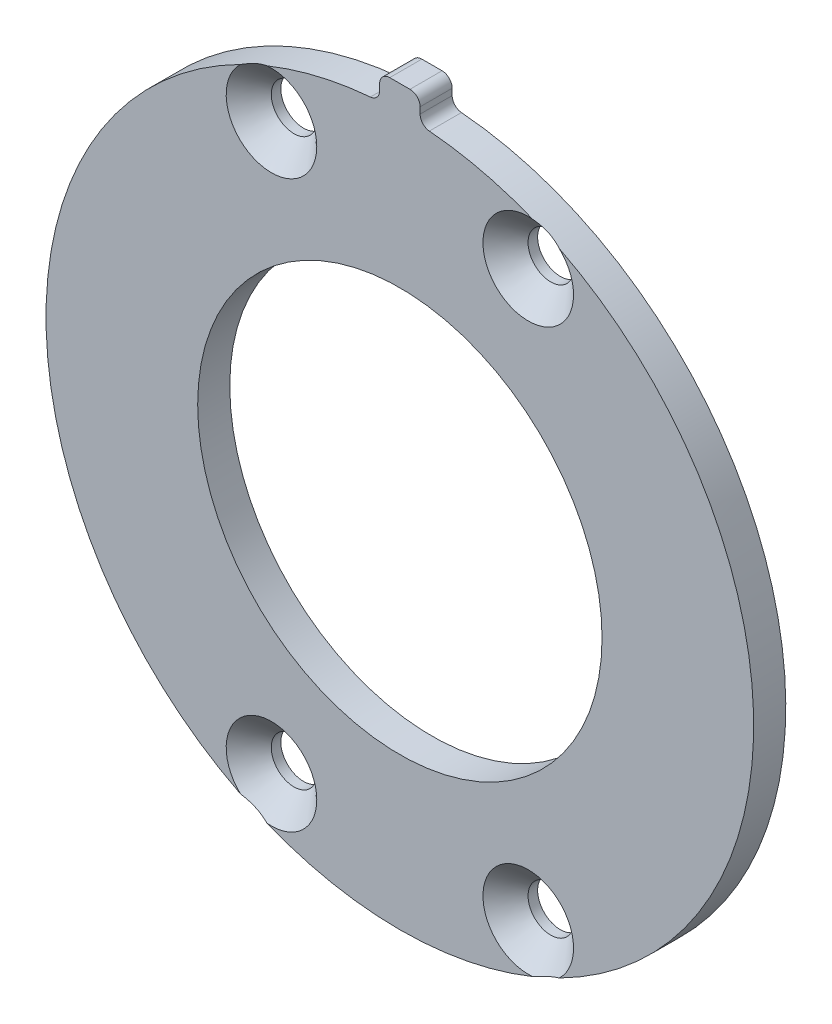
ISO-10303-21;
HEADER;
FILE_DESCRIPTION(('STEP AP214'),'2;1');
FILE_NAME('part.step','',(''),(''),'','','');
FILE_SCHEMA(('AUTOMOTIVE_DESIGN { 1 0 10303 214 1 1 1 1 }'));
ENDSEC;
DATA;
#1=APPLICATION_CONTEXT('core data for automotive mechanical design processes');
#2=APPLICATION_PROTOCOL_DEFINITION('international standard','automotive_design',2000,#1);
#3=PRODUCT_CONTEXT('',#1,'mechanical');
#4=PRODUCT('Part','Part','',(#3));
#5=PRODUCT_RELATED_PRODUCT_CATEGORY('part','',(#4));
#6=PRODUCT_DEFINITION_FORMATION('','',#4);
#7=PRODUCT_DEFINITION_CONTEXT('part definition',#1,'design');
#8=PRODUCT_DEFINITION('design','',#6,#7);
#9=PRODUCT_DEFINITION_SHAPE('','',#8);
#10=(LENGTH_UNIT() NAMED_UNIT(*) SI_UNIT(.MILLI.,.METRE.));
#11=(NAMED_UNIT(*) PLANE_ANGLE_UNIT() SI_UNIT($,.RADIAN.));
#12=(NAMED_UNIT(*) SI_UNIT($,.STERADIAN.) SOLID_ANGLE_UNIT());
#13=UNCERTAINTY_MEASURE_WITH_UNIT(LENGTH_MEASURE(1.E-05),#10,'distance_accuracy_value','');
#14=(GEOMETRIC_REPRESENTATION_CONTEXT(3) GLOBAL_UNCERTAINTY_ASSIGNED_CONTEXT((#13)) GLOBAL_UNIT_ASSIGNED_CONTEXT((#10,
#11,#12)) REPRESENTATION_CONTEXT('',''));
#15=CARTESIAN_POINT('',(0.,0.,0.));
#16=DIRECTION('',(0.,0.,1.));
#17=DIRECTION('',(1.,0.,0.));
#18=AXIS2_PLACEMENT_3D('',#15,#16,#17);
#19=CARTESIAN_POINT('',(0.,0.,3.175));
#20=DIRECTION('',(0.,0.,-1.));
#21=DIRECTION('',(-1.,0.,0.));
#22=AXIS2_PLACEMENT_3D('',#19,#20,#21);
#23=CYLINDRICAL_SURFACE('',#22,20.);
#24=CARTESIAN_POINT('',(0.,0.,3.175));
#25=DIRECTION('',(0.,0.,1.));
#26=DIRECTION('',(1.,0.,0.));
#27=AXIS2_PLACEMENT_3D('',#24,#25,#26);
#28=CIRCLE('',#27,20.);
#29=CARTESIAN_POINT('',(20.,0.,3.175));
#30=VERTEX_POINT('',#29);
#31=EDGE_CURVE('E163',#30,#30,#28,.T.);
#32=ORIENTED_EDGE('',*,*,#31,.T.);
#33=EDGE_LOOP('',(#32));
#34=FACE_BOUND('',#33,.T.);
#35=CARTESIAN_POINT('',(0.,0.,0.));
#36=DIRECTION('',(0.,0.,1.));
#37=DIRECTION('',(1.,0.,0.));
#38=AXIS2_PLACEMENT_3D('',#35,#36,#37);
#39=CIRCLE('',#38,20.);
#40=CARTESIAN_POINT('',(20.,0.,0.));
#41=VERTEX_POINT('',#40);
#42=EDGE_CURVE('E323',#41,#41,#39,.T.);
#43=ORIENTED_EDGE('',*,*,#42,.F.);
#44=EDGE_LOOP('',(#43));
#45=FACE_BOUND('',#44,.T.);
#46=ADVANCED_FACE('F47',(#34,#45),#23,.F.);
#47=CARTESIAN_POINT('',(0.,0.,3.175));
#48=DIRECTION('',(0.,0.,-1.));
#49=DIRECTION('',(-1.,0.,0.));
#50=AXIS2_PLACEMENT_3D('',#47,#48,#49);
#51=CYLINDRICAL_SURFACE('',#50,35.);
#52=CARTESIAN_POINT('',(0.,0.,3.175));
#53=DIRECTION('',(0.,0.,1.));
#54=DIRECTION('',(1.,0.,0.));
#55=AXIS2_PLACEMENT_3D('',#52,#53,#54);
#56=CIRCLE('',#55,35.);
#57=CARTESIAN_POINT('',(-2.91666666666667,34.8782605007124,3.175));
#58=VERTEX_POINT('',#57);
#59=CARTESIAN_POINT('',(-13.1457830587167,32.4374534723853,3.175));
#60=VERTEX_POINT('',#59);
#61=EDGE_CURVE('E151',#58,#60,#56,.T.);
#62=ORIENTED_EDGE('',*,*,#61,.F.);
#63=DIRECTION('',(0.,0.,-1.));
#64=VECTOR('',#63,1.);
#65=CARTESIAN_POINT('',(-2.91666666666667,34.8782605007124,3.175));
#66=LINE('',#65,#64);
#67=CARTESIAN_POINT('',(-2.91666666666667,34.8782605007124,0.));
#68=VERTEX_POINT('',#67);
#69=EDGE_CURVE('E263',#58,#68,#66,.T.);
#70=ORIENTED_EDGE('',*,*,#69,.T.);
#71=CARTESIAN_POINT('',(0.,0.,0.));
#72=DIRECTION('',(0.,0.,1.));
#73=DIRECTION('',(1.,0.,0.));
#74=AXIS2_PLACEMENT_3D('',#71,#72,#73);
#75=CIRCLE('',#74,35.);
#76=CARTESIAN_POINT('',(2.91666666666667,34.8782605007124,0.));
#77=VERTEX_POINT('',#76);
#78=EDGE_CURVE('E182',#68,#77,#75,.T.);
#79=ORIENTED_EDGE('',*,*,#78,.T.);
#80=DIRECTION('',(0.,0.,-1.));
#81=VECTOR('',#80,1.);
#82=CARTESIAN_POINT('',(2.91666666666667,34.8782605007124,3.175));
#83=LINE('',#82,#81);
#84=CARTESIAN_POINT('',(2.91666666666667,34.8782605007124,3.175));
#85=VERTEX_POINT('',#84);
#86=EDGE_CURVE('E142',#77,#85,#83,.F.);
#87=ORIENTED_EDGE('',*,*,#86,.T.);
#88=CARTESIAN_POINT('',(13.1457830587149,32.437453472386,3.175));
#89=VERTEX_POINT('',#88);
#90=EDGE_CURVE('E161',#89,#85,#56,.T.);
#91=ORIENTED_EDGE('',*,*,#90,.F.);
#92=CARTESIAN_POINT('',(12.7530802206111,32.5938482675283,3.30946606861702));
#93=CARTESIAN_POINT('',(12.8177837794812,32.5685314442767,3.28489627540469));
#94=CARTESIAN_POINT('',(12.8827550508194,32.5428878404432,3.26137405625743));
#95=CARTESIAN_POINT('',(13.0134395880967,32.4908503525877,3.21654519717089));
#96=CARTESIAN_POINT('',(13.0791546214918,32.4644542222017,3.19524632853202));
#97=CARTESIAN_POINT('',(13.2781189833976,32.383825201883,3.13478708581808));
#98=CARTESIAN_POINT('',(13.4121500121269,32.3285571051347,3.09946469331322));
#99=CARTESIAN_POINT('',(13.6817529834378,32.2153846746017,3.04062640104528));
#100=CARTESIAN_POINT('',(13.8173253376726,32.1574796235158,3.01711373492695));
#101=CARTESIAN_POINT('',(14.0889143117362,32.0394189677215,2.98323073950611));
#102=CARTESIAN_POINT('',(14.2249299172378,31.9792669904965,2.97284009602487));
#103=CARTESIAN_POINT('',(14.4964231231112,31.8571166752754,2.96576514402205));
#104=CARTESIAN_POINT('',(14.6319008832349,31.7951189406272,2.96907640436761));
#105=CARTESIAN_POINT('',(14.9363760066117,31.6534309110511,2.99185191526379));
#106=CARTESIAN_POINT('',(15.1049043286439,31.573341780462,3.01530217304525));
#107=CARTESIAN_POINT('',(15.3542480434255,31.4524345798508,3.06497517022203));
#108=CARTESIAN_POINT('',(15.4367935703604,31.4120003579427,3.08395097028311));
#109=CARTESIAN_POINT('',(15.6006504882809,31.3309439968307,3.12634316917397));
#110=CARTESIAN_POINT('',(15.681961821879,31.2903218490025,3.14975977381318));
#111=CARTESIAN_POINT('',(15.9923328443849,31.1337672639739,3.24766130036524));
#112=CARTESIAN_POINT('',(16.2166995684813,31.0174124418311,3.33653982026261));
#113=CARTESIAN_POINT('',(16.6545671327644,30.7845278694084,3.53794196056448));
#114=CARTESIAN_POINT('',(16.8680480770957,30.6679981732285,3.65050707495304));
#115=CARTESIAN_POINT('',(17.286784530432,30.4339446104218,3.89296996968937));
#116=CARTESIAN_POINT('',(17.4919688421297,30.3164196822448,4.02298796882929));
#117=CARTESIAN_POINT('',(17.8938949217776,30.0809365991982,4.29464457004465));
#118=CARTESIAN_POINT('',(18.0906420136845,29.9629787700724,4.43627567480205));
#119=CARTESIAN_POINT('',(18.3850618123991,29.7826047596978,4.65840910359178));
#120=CARTESIAN_POINT('',(18.4852580054248,29.7205143131009,4.73587028328792));
#121=CARTESIAN_POINT('',(18.6839134790919,29.596032207709,4.89275701113362));
#122=CARTESIAN_POINT('',(18.7823727517777,29.5336405475359,4.97218256827677));
#123=CARTESIAN_POINT('',(18.9765351645422,29.4092544850332,5.13174663382806));
#124=CARTESIAN_POINT('',(19.0722571528218,29.3472641723716,5.2118654543554));
#125=CARTESIAN_POINT('',(19.2622565441203,29.222907925896,5.37350896485753));
#126=CARTESIAN_POINT('',(19.3565339717829,29.1605419985151,5.45503363079859));
#127=CARTESIAN_POINT('',(19.450147410684,29.097968411947,5.53715187378861));
#128=B_SPLINE_CURVE_WITH_KNOTS('',3,(#92,#93,#94,#95,#96,#97,#98,#99,#100,#101,#102,#103,#104,
#105,#106,#107,#108,#109,#110,#111,#112,#113,#114,#115,#116,#117,#118,#119,#120,#121,#122,#123,
#124,#125,#126,#127),.UNSPECIFIED.,.F.,.F.,(4,2,2,2,2,2,2,2,2,2,2,2,2,2,2,2,2,4),(0.,
0.221073406332503,0.442895336225531,0.890082989672575,1.33739302180363,1.7840097218162,
2.23048199932607,2.79334869605478,3.07482209858569,3.35630854921195,4.15806534559636,
4.96123852307315,5.77025894227303,6.57876111640781,7.00188780428454,7.42501642973659,
7.84311692980672,8.26121028928092),.UNSPECIFIED.);
#129=CARTESIAN_POINT('',(15.7619791753685,31.2499601995786,3.175));
#130=VERTEX_POINT('',#129);
#131=EDGE_CURVE('E143',#89,#130,#128,.T.);
#132=ORIENTED_EDGE('',*,*,#131,.T.);
#133=CARTESIAN_POINT('',(15.7619791753684,-31.2499601995788,3.175));
#134=VERTEX_POINT('',#133);
#135=EDGE_CURVE('E162',#134,#130,#56,.T.);
#136=ORIENTED_EDGE('',*,*,#135,.F.);
#137=CARTESIAN_POINT('',(15.7626133632051,-31.2496403173238,3.17520000000069));
#138=CARTESIAN_POINT('',(15.6978293351409,-31.2823179975497,3.1547643543795));
#139=CARTESIAN_POINT('',(15.6326183930712,-31.3149581921728,3.1356341093607));
#140=CARTESIAN_POINT('',(15.5013664369167,-31.3801372189379,3.10018476086793));
#141=CARTESIAN_POINT('',(15.4353252172812,-31.4126760233879,3.08386636883429));
#142=CARTESIAN_POINT('',(15.2359306309192,-31.5101300498544,3.03941955783499));
#143=CARTESIAN_POINT('',(15.101414375926,-31.5748283404476,3.01583423012008));
#144=CARTESIAN_POINT('',(14.8335546609062,-31.7015309290892,2.98254478899766));
#145=CARTESIAN_POINT('',(14.7002650492463,-31.7635622272398,2.9725104636828));
#146=CARTESIAN_POINT('',(14.4327164177344,-31.8860205748792,2.96584883062085));
#147=CARTESIAN_POINT('',(14.2984582401738,-31.9464488444163,2.96921101398393));
#148=CARTESIAN_POINT('',(14.0793214053752,-32.0434292519206,2.98544321619201));
#149=CARTESIAN_POINT('',(13.994402167229,-32.0806054886866,2.99437135050943));
#150=CARTESIAN_POINT('',(13.8248352570549,-32.1540427093884,3.01727908424546));
#151=CARTESIAN_POINT('',(13.7401876140638,-32.1903035981336,3.03125920674409));
#152=CARTESIAN_POINT('',(13.5700567062427,-32.2623965570017,3.06423351412097));
#153=CARTESIAN_POINT('',(13.4845815973138,-32.2982126055764,3.08330399282949));
#154=CARTESIAN_POINT('',(13.3143052401821,-32.3687779249475,3.12596199737166));
#155=CARTESIAN_POINT('',(13.2295040733561,-32.4035270683258,3.14955006031386));
#156=CARTESIAN_POINT('',(13.1451247657722,-32.4377202480736,3.17520000000003));
#157=B_SPLINE_CURVE_WITH_KNOTS('',3,(#137,#138,#139,#140,#141,#142,#143,#144,#145,#146,#147,
#148,#149,#150,#151,#152,#153,#154,#155,#156),.UNSPECIFIED.,.F.,.F.,(4,2,2,2,2,2,2,2,2,4),(0.,
0.226122346154235,0.452301820861845,0.90503740633218,1.3465286323258,1.78767359878422,
2.06693089485356,2.34621711335468,2.62995037343929,2.91371738834988),.UNSPECIFIED.);
#158=CARTESIAN_POINT('',(13.1457830587147,-32.4374534723861,3.175));
#159=VERTEX_POINT('',#158);
#160=EDGE_CURVE('E169',#134,#159,#157,.T.);
#161=ORIENTED_EDGE('',*,*,#160,.T.);
#162=CARTESIAN_POINT('',(-13.1457830587147,-32.4374534723861,3.175));
#163=VERTEX_POINT('',#162);
#164=EDGE_CURVE('E159',#163,#159,#56,.T.);
#165=ORIENTED_EDGE('',*,*,#164,.F.);
#166=CARTESIAN_POINT('',(-12.7530802206111,-32.5938482675283,3.30946606861701));
#167=CARTESIAN_POINT('',(-12.8177837794809,-32.5685314442768,3.28489627540483));
#168=CARTESIAN_POINT('',(-12.8827550508187,-32.5428878404435,3.26137405625768));
#169=CARTESIAN_POINT('',(-13.0134395880952,-32.4908503525883,3.21654519717136));
#170=CARTESIAN_POINT('',(-13.0791546214901,-32.4644542222024,3.19524632853259));
#171=CARTESIAN_POINT('',(-13.2781189833955,-32.3838252018839,3.13478708581865));
#172=CARTESIAN_POINT('',(-13.4121500121249,-32.3285571051355,3.09946469331372));
#173=CARTESIAN_POINT('',(-13.6817529834358,-32.2153846746025,3.04062640104564));
#174=CARTESIAN_POINT('',(-13.8173253376707,-32.1574796235167,3.01711373492725));
#175=CARTESIAN_POINT('',(-14.0889143117344,-32.0394189677223,2.98323073950627));
#176=CARTESIAN_POINT('',(-14.2249299172361,-31.9792669904973,2.97284009602497));
#177=CARTESIAN_POINT('',(-14.4964231231096,-31.8571166752762,2.96576514402203));
#178=CARTESIAN_POINT('',(-14.6319008832334,-31.7951189406279,2.96907640436754));
#179=CARTESIAN_POINT('',(-14.9363760066105,-31.6534309110517,2.99185191526362));
#180=CARTESIAN_POINT('',(-15.1049043286429,-31.5733417804624,3.01530217304507));
#181=CARTESIAN_POINT('',(-15.3542480434249,-31.4524345798511,3.06497517022189));
#182=CARTESIAN_POINT('',(-15.4367935703599,-31.4120003579429,3.08395097028299));
#183=CARTESIAN_POINT('',(-15.6006504882807,-31.3309439968308,3.12634316917391));
#184=CARTESIAN_POINT('',(-15.6819618218789,-31.2903218490025,3.14975977381315));
#185=CARTESIAN_POINT('',(-15.9923328443849,-31.1337672639738,3.24766130036523));
#186=CARTESIAN_POINT('',(-16.2166995684813,-31.0174124418311,3.33653982026261));
#187=CARTESIAN_POINT('',(-16.6545671327644,-30.7845278694084,3.5379419605645));
#188=CARTESIAN_POINT('',(-16.8680480770958,-30.6679981732285,3.65050707495306));
#189=CARTESIAN_POINT('',(-17.2867845304321,-30.4339446104218,3.8929699696894));
#190=CARTESIAN_POINT('',(-17.4919688421298,-30.3164196822448,4.02298796882932));
#191=CARTESIAN_POINT('',(-17.8938949217777,-30.0809365991981,4.29464457004469));
#192=CARTESIAN_POINT('',(-18.0906420136846,-29.9629787700723,4.43627567480209));
#193=CARTESIAN_POINT('',(-18.3850618123992,-29.7826047596977,4.65840910359182));
#194=CARTESIAN_POINT('',(-18.4852580054248,-29.7205143131009,4.73587028328795));
#195=CARTESIAN_POINT('',(-18.683913479092,-29.596032207709,4.89275701113365));
#196=CARTESIAN_POINT('',(-18.7823727517777,-29.5336405475359,4.97218256827679));
#197=CARTESIAN_POINT('',(-18.9765351645422,-29.4092544850332,5.13174663382808));
#198=CARTESIAN_POINT('',(-19.0722571528218,-29.3472641723716,5.21186545435541));
#199=CARTESIAN_POINT('',(-19.2622565441204,-29.222907925896,5.37350896485754));
#200=CARTESIAN_POINT('',(-19.3565339717829,-29.1605419985151,5.45503363079859));
#201=CARTESIAN_POINT('',(-19.450147410684,-29.097968411947,5.53715187378861));
#202=B_SPLINE_CURVE_WITH_KNOTS('',3,(#166,#167,#168,#169,#170,#171,#172,#173,#174,#175,#176,
#177,#178,#179,#180,#181,#182,#183,#184,#185,#186,#187,#188,#189,#190,#191,#192,#193,#194,#195,
#196,#197,#198,#199,#200,#201),.UNSPECIFIED.,.F.,.F.,(4,2,2,2,2,2,2,2,2,2,2,2,2,2,2,2,2,4),(0.,
0.221073406331293,0.442895336223102,0.890082989670337,1.33739302180159,1.78400972181435,
2.23048199932441,2.79334869605397,3.0748220985853,3.35630854921198,4.1580653455964,
4.96123852307321,5.77025894227309,6.57876111640789,7.0018878042846,7.42501642973663,
7.84311692980674,8.26121028928092),.UNSPECIFIED.);
#203=CARTESIAN_POINT('',(-15.7619791753685,-31.2499601995786,3.175));
#204=VERTEX_POINT('',#203);
#205=EDGE_CURVE('E158',#163,#204,#202,.T.);
#206=ORIENTED_EDGE('',*,*,#205,.T.);
#207=CARTESIAN_POINT('',(-15.7619791753652,31.2499601995804,3.175));
#208=VERTEX_POINT('',#207);
#209=EDGE_CURVE('E149',#208,#204,#56,.T.);
#210=ORIENTED_EDGE('',*,*,#209,.F.);
#211=CARTESIAN_POINT('',(-15.7626133632018,31.2496403173255,3.17520000000069));
#212=CARTESIAN_POINT('',(-15.6978293351376,31.2823179975514,3.15476435437954));
#213=CARTESIAN_POINT('',(-15.6326183930679,31.3149581921744,3.13563410936079));
#214=CARTESIAN_POINT('',(-15.5013664369134,31.3801372189395,3.10018476086811));
#215=CARTESIAN_POINT('',(-15.4353252172779,31.4126760233895,3.08386636883453));
#216=CARTESIAN_POINT('',(-15.235930630916,31.5101300498559,3.03941955783537));
#217=CARTESIAN_POINT('',(-15.1014143759228,31.5748283404491,3.01583423012055));
#218=CARTESIAN_POINT('',(-14.8335546609031,31.7015309290906,2.9825447889983));
#219=CARTESIAN_POINT('',(-14.7002650492433,31.7635622272412,2.97251046368353));
#220=CARTESIAN_POINT('',(-14.4327164177314,31.8860205748806,2.96584883062173));
#221=CARTESIAN_POINT('',(-14.2984582401708,31.9464488444176,2.96921101398489));
#222=CARTESIAN_POINT('',(-14.0793214053725,32.0434292519218,2.98544321619306));
#223=CARTESIAN_POINT('',(-13.9944021672265,32.0806054886877,2.99437135051049));
#224=CARTESIAN_POINT('',(-13.8248352570529,32.1540427093893,3.01727908424652));
#225=CARTESIAN_POINT('',(-13.7401876140621,32.1903035981343,3.03125920674513));
#226=CARTESIAN_POINT('',(-13.5700567062414,32.2623965570022,3.06423351412195));
#227=CARTESIAN_POINT('',(-13.4845815973127,32.2982126055769,3.08330399283042));
#228=CARTESIAN_POINT('',(-13.3143052401815,32.3687779249477,3.12596199737247));
#229=CARTESIAN_POINT('',(-13.2295040733557,32.4035270683259,3.14955006031459));
#230=CARTESIAN_POINT('',(-13.145124765772,32.4377202480737,3.17520000000068));
#231=B_SPLINE_CURVE_WITH_KNOTS('',3,(#211,#212,#213,#214,#215,#216,#217,#218,#219,#220,#221,
#222,#223,#224,#225,#226,#227,#228,#229,#230),.UNSPECIFIED.,.F.,.F.,(4,2,2,2,2,2,2,2,2,4),(0.,
0.226122346154146,0.452301820861672,0.905037406331823,1.34652863232529,1.78767359878356,
2.06693089485215,2.34621711335253,2.62995037343637,2.9137173883462),.UNSPECIFIED.);
#232=EDGE_CURVE('E135',#208,#60,#231,.T.);
#233=ORIENTED_EDGE('',*,*,#232,.T.);
#234=EDGE_LOOP('',(#62,#70,#79,#87,#91,#132,#136,#161,#165,#206,#210,#233));
#235=FACE_BOUND('',#234,.T.);
#236=ADVANCED_FACE('F156',(#235),#51,.T.);
#237=CARTESIAN_POINT('',(0.,0.,3.175));
#238=DIRECTION('',(0.,0.,1.));
#239=DIRECTION('',(1.,0.,0.));
#240=AXIS2_PLACEMENT_3D('',#237,#238,#239);
#241=PLANE('',#240);
#242=DIRECTION('',(1.,0.,0.));
#243=VECTOR('',#242,1.);
#244=CARTESIAN_POINT('',(-2.,37.5,3.175));
#245=LINE('',#244,#243);
#246=CARTESIAN_POINT('',(-1.,37.5,3.175));
#247=VERTEX_POINT('',#246);
#248=CARTESIAN_POINT('',(0.999999999999998,37.5,3.175));
#249=VERTEX_POINT('',#248);
#250=EDGE_CURVE('E282',#247,#249,#245,.T.);
#251=ORIENTED_EDGE('',*,*,#250,.F.);
#252=CARTESIAN_POINT('',(-1.,36.5,3.175));
#253=DIRECTION('',(0.,0.,1.));
#254=DIRECTION('',(1.,0.,0.));
#255=AXIS2_PLACEMENT_3D('',#252,#253,#254);
#256=CIRCLE('',#255,1.);
#257=CARTESIAN_POINT('',(-2.,36.5,3.175));
#258=VERTEX_POINT('',#257);
#259=EDGE_CURVE('E242',#247,#258,#256,.T.);
#260=ORIENTED_EDGE('',*,*,#259,.T.);
#261=DIRECTION('',(0.,1.,0.));
#262=VECTOR('',#261,1.);
#263=CARTESIAN_POINT('',(-2.,32.5,3.175));
#264=LINE('',#263,#262);
#265=CARTESIAN_POINT('',(-2.,35.8747822293042,3.175));
#266=VERTEX_POINT('',#265);
#267=EDGE_CURVE('E258',#266,#258,#264,.T.);
#268=ORIENTED_EDGE('',*,*,#267,.F.);
#269=CARTESIAN_POINT('',(-3.,35.8747822293042,3.175));
#270=DIRECTION('',(0.,0.,1.));
#271=DIRECTION('',(1.,0.,0.));
#272=AXIS2_PLACEMENT_3D('',#269,#270,#271);
#273=CIRCLE('',#272,1.);
#274=EDGE_CURVE('E254',#266,#58,#273,.F.);
#275=ORIENTED_EDGE('',*,*,#274,.T.);
#276=ORIENTED_EDGE('',*,*,#61,.T.);
#277=CARTESIAN_POINT('',(-12.699999999999,27.9796874999995,3.175));
#278=DIRECTION('',(0.,0.,1.));
#279=DIRECTION('',(1.,0.,0.));
#280=AXIS2_PLACEMENT_3D('',#277,#278,#279);
#281=CIRCLE('',#280,4.48);
#282=EDGE_CURVE('E138',#208,#60,#281,.T.);
#283=ORIENTED_EDGE('',*,*,#282,.F.);
#284=ORIENTED_EDGE('',*,*,#209,.T.);
#285=CARTESIAN_POINT('',(-12.7,-27.9796875,3.175));
#286=DIRECTION('',(0.,0.,1.));
#287=DIRECTION('',(1.,0.,0.));
#288=AXIS2_PLACEMENT_3D('',#285,#286,#287);
#289=CIRCLE('',#288,4.48);
#290=EDGE_CURVE('E307',#163,#204,#289,.T.);
#291=ORIENTED_EDGE('',*,*,#290,.F.);
#292=ORIENTED_EDGE('',*,*,#164,.T.);
#293=CARTESIAN_POINT('',(12.7,-27.9796875,3.175));
#294=DIRECTION('',(0.,0.,1.));
#295=DIRECTION('',(1.,0.,0.));
#296=AXIS2_PLACEMENT_3D('',#293,#294,#295);
#297=CIRCLE('',#296,4.48);
#298=EDGE_CURVE('E315',#134,#159,#297,.T.);
#299=ORIENTED_EDGE('',*,*,#298,.F.);
#300=ORIENTED_EDGE('',*,*,#135,.T.);
#301=CARTESIAN_POINT('',(12.7,27.9796875,3.175));
#302=DIRECTION('',(0.,0.,1.));
#303=DIRECTION('',(1.,0.,0.));
#304=AXIS2_PLACEMENT_3D('',#301,#302,#303);
#305=CIRCLE('',#304,4.48);
#306=EDGE_CURVE('E299',#89,#130,#305,.T.);
#307=ORIENTED_EDGE('',*,*,#306,.F.);
#308=ORIENTED_EDGE('',*,*,#90,.T.);
#309=CARTESIAN_POINT('',(3.,35.8747822293042,3.175));
#310=DIRECTION('',(0.,0.,1.));
#311=DIRECTION('',(1.,0.,0.));
#312=AXIS2_PLACEMENT_3D('',#309,#310,#311);
#313=CIRCLE('',#312,1.);
#314=CARTESIAN_POINT('',(2.,35.8747822293042,3.175));
#315=VERTEX_POINT('',#314);
#316=EDGE_CURVE('E55',#85,#315,#313,.F.);
#317=ORIENTED_EDGE('',*,*,#316,.T.);
#318=DIRECTION('',(0.,-1.,0.));
#319=VECTOR('',#318,1.);
#320=CARTESIAN_POINT('',(2.,32.5,3.175));
#321=LINE('',#320,#319);
#322=CARTESIAN_POINT('',(2.,36.5,3.175));
#323=VERTEX_POINT('',#322);
#324=EDGE_CURVE('E153',#323,#315,#321,.T.);
#325=ORIENTED_EDGE('',*,*,#324,.F.);
#326=CARTESIAN_POINT('',(0.999999999999998,36.5,3.175));
#327=DIRECTION('',(0.,0.,1.));
#328=DIRECTION('',(1.,0.,0.));
#329=AXIS2_PLACEMENT_3D('',#326,#327,#328);
#330=CIRCLE('',#329,1.);
#331=EDGE_CURVE('E238',#323,#249,#330,.T.);
#332=ORIENTED_EDGE('',*,*,#331,.T.);
#333=EDGE_LOOP('',(#251,#260,#268,#275,#276,#283,#284,#291,#292,#299,#300,#307,#308,#317,#325,#332));
#334=FACE_BOUND('',#333,.T.);
#335=ORIENTED_EDGE('',*,*,#31,.F.);
#336=EDGE_LOOP('',(#335));
#337=FACE_BOUND('',#336,.T.);
#338=ADVANCED_FACE('F146',(#334,#337),#241,.T.);
#339=CARTESIAN_POINT('',(0.,0.,0.));
#340=DIRECTION('',(0.,0.,1.));
#341=DIRECTION('',(1.,0.,0.));
#342=AXIS2_PLACEMENT_3D('',#339,#340,#341);
#343=PLANE('',#342);
#344=CARTESIAN_POINT('',(-12.699999999999,27.9796874999995,0.));
#345=DIRECTION('',(0.,0.,1.));
#346=DIRECTION('',(1.,0.,0.));
#347=AXIS2_PLACEMENT_3D('',#344,#345,#346);
#348=CIRCLE('',#347,2.25);
#349=CARTESIAN_POINT('',(-10.449999999999,27.9796874999995,0.));
#350=VERTEX_POINT('',#349);
#351=EDGE_CURVE('E297',#350,#350,#348,.T.);
#352=ORIENTED_EDGE('',*,*,#351,.T.);
#353=EDGE_LOOP('',(#352));
#354=FACE_BOUND('',#353,.T.);
#355=CARTESIAN_POINT('',(12.7,27.9796875,0.));
#356=DIRECTION('',(0.,0.,1.));
#357=DIRECTION('',(1.,0.,0.));
#358=AXIS2_PLACEMENT_3D('',#355,#356,#357);
#359=CIRCLE('',#358,2.25);
#360=CARTESIAN_POINT('',(14.95,27.9796875,0.));
#361=VERTEX_POINT('',#360);
#362=EDGE_CURVE('E304',#361,#361,#359,.T.);
#363=ORIENTED_EDGE('',*,*,#362,.T.);
#364=EDGE_LOOP('',(#363));
#365=FACE_BOUND('',#364,.T.);
#366=CARTESIAN_POINT('',(-12.7,-27.9796875,0.));
#367=DIRECTION('',(0.,0.,1.));
#368=DIRECTION('',(1.,0.,0.));
#369=AXIS2_PLACEMENT_3D('',#366,#367,#368);
#370=CIRCLE('',#369,2.25);
#371=CARTESIAN_POINT('',(-10.45,-27.9796875,0.));
#372=VERTEX_POINT('',#371);
#373=EDGE_CURVE('E312',#372,#372,#370,.T.);
#374=ORIENTED_EDGE('',*,*,#373,.T.);
#375=EDGE_LOOP('',(#374));
#376=FACE_BOUND('',#375,.T.);
#377=CARTESIAN_POINT('',(12.7,-27.9796875,0.));
#378=DIRECTION('',(0.,0.,1.));
#379=DIRECTION('',(1.,0.,0.));
#380=AXIS2_PLACEMENT_3D('',#377,#378,#379);
#381=CIRCLE('',#380,2.25);
#382=CARTESIAN_POINT('',(14.95,-27.9796875,0.));
#383=VERTEX_POINT('',#382);
#384=EDGE_CURVE('E321',#383,#383,#381,.T.);
#385=ORIENTED_EDGE('',*,*,#384,.T.);
#386=EDGE_LOOP('',(#385));
#387=FACE_BOUND('',#386,.T.);
#388=ORIENTED_EDGE('',*,*,#42,.T.);
#389=EDGE_LOOP('',(#388));
#390=FACE_BOUND('',#389,.T.);
#391=DIRECTION('',(0.,1.,0.));
#392=VECTOR('',#391,1.);
#393=CARTESIAN_POINT('',(-2.,32.5,0.));
#394=LINE('',#393,#392);
#395=CARTESIAN_POINT('',(-2.,35.8747822293042,0.));
#396=VERTEX_POINT('',#395);
#397=CARTESIAN_POINT('',(-2.,36.5,0.));
#398=VERTEX_POINT('',#397);
#399=EDGE_CURVE('E286',#396,#398,#394,.T.);
#400=ORIENTED_EDGE('',*,*,#399,.T.);
#401=CARTESIAN_POINT('',(-1.,36.5,0.));
#402=DIRECTION('',(0.,0.,1.));
#403=DIRECTION('',(1.,0.,0.));
#404=AXIS2_PLACEMENT_3D('',#401,#402,#403);
#405=CIRCLE('',#404,1.);
#406=CARTESIAN_POINT('',(-1.,37.5,0.));
#407=VERTEX_POINT('',#406);
#408=EDGE_CURVE('E276',#398,#407,#405,.F.);
#409=ORIENTED_EDGE('',*,*,#408,.T.);
#410=DIRECTION('',(1.,0.,0.));
#411=VECTOR('',#410,1.);
#412=CARTESIAN_POINT('',(-2.,37.5,0.));
#413=LINE('',#412,#411);
#414=CARTESIAN_POINT('',(0.999999999999998,37.5,0.));
#415=VERTEX_POINT('',#414);
#416=EDGE_CURVE('E280',#407,#415,#413,.T.);
#417=ORIENTED_EDGE('',*,*,#416,.T.);
#418=CARTESIAN_POINT('',(0.999999999999998,36.5,0.));
#419=DIRECTION('',(0.,0.,1.));
#420=DIRECTION('',(1.,0.,0.));
#421=AXIS2_PLACEMENT_3D('',#418,#419,#420);
#422=CIRCLE('',#421,1.);
#423=CARTESIAN_POINT('',(2.,36.5,0.));
#424=VERTEX_POINT('',#423);
#425=EDGE_CURVE('E274',#415,#424,#422,.F.);
#426=ORIENTED_EDGE('',*,*,#425,.T.);
#427=DIRECTION('',(0.,-1.,0.));
#428=VECTOR('',#427,1.);
#429=CARTESIAN_POINT('',(2.,32.5,0.));
#430=LINE('',#429,#428);
#431=CARTESIAN_POINT('',(2.,35.8747822293042,0.));
#432=VERTEX_POINT('',#431);
#433=EDGE_CURVE('E289',#424,#432,#430,.T.);
#434=ORIENTED_EDGE('',*,*,#433,.T.);
#435=CARTESIAN_POINT('',(3.,35.8747822293042,0.));
#436=DIRECTION('',(0.,0.,1.));
#437=DIRECTION('',(1.,0.,0.));
#438=AXIS2_PLACEMENT_3D('',#435,#436,#437);
#439=CIRCLE('',#438,1.);
#440=EDGE_CURVE('E11',#432,#77,#439,.T.);
#441=ORIENTED_EDGE('',*,*,#440,.T.);
#442=ORIENTED_EDGE('',*,*,#78,.F.);
#443=CARTESIAN_POINT('',(-3.,35.8747822293042,0.));
#444=DIRECTION('',(0.,0.,1.));
#445=DIRECTION('',(1.,0.,0.));
#446=AXIS2_PLACEMENT_3D('',#443,#444,#445);
#447=CIRCLE('',#446,1.);
#448=EDGE_CURVE('E252',#68,#396,#447,.T.);
#449=ORIENTED_EDGE('',*,*,#448,.T.);
#450=EDGE_LOOP('',(#400,#409,#417,#426,#434,#441,#442,#449));
#451=FACE_BOUND('',#450,.T.);
#452=ADVANCED_FACE('F198',(#354,#365,#376,#387,#390,#451),#343,.F.);
#453=CARTESIAN_POINT('',(12.7,-27.9796875,3.175));
#454=DIRECTION('',(0.,0.,1.));
#455=DIRECTION('',(1.,0.,0.));
#456=AXIS2_PLACEMENT_3D('',#453,#454,#455);
#457=CONICAL_SURFACE('',#456,4.48,0.785398163397448);
#458=CARTESIAN_POINT('',(12.7,-27.9796875,0.944999999999999));
#459=DIRECTION('',(0.,0.,1.));
#460=DIRECTION('',(1.,0.,0.));
#461=AXIS2_PLACEMENT_3D('',#458,#459,#460);
#462=CIRCLE('',#461,2.25);
#463=CARTESIAN_POINT('',(14.95,-27.9796875,0.944999999999999));
#464=VERTEX_POINT('',#463);
#465=EDGE_CURVE('E318',#464,#464,#462,.T.);
#466=ORIENTED_EDGE('',*,*,#465,.F.);
#467=EDGE_LOOP('',(#466));
#468=FACE_BOUND('',#467,.T.);
#469=ORIENTED_EDGE('',*,*,#298,.T.);
#470=ORIENTED_EDGE('',*,*,#160,.F.);
#471=EDGE_LOOP('',(#469,#470));
#472=FACE_BOUND('',#471,.T.);
#473=ADVANCED_FACE('F192',(#468,#472),#457,.F.);
#474=CARTESIAN_POINT('',(12.7,-27.9796875,3.175));
#475=DIRECTION('',(0.,0.,1.));
#476=DIRECTION('',(1.,0.,0.));
#477=AXIS2_PLACEMENT_3D('',#474,#475,#476);
#478=CYLINDRICAL_SURFACE('',#477,2.25);
#479=ORIENTED_EDGE('',*,*,#384,.F.);
#480=EDGE_LOOP('',(#479));
#481=FACE_BOUND('',#480,.T.);
#482=ORIENTED_EDGE('',*,*,#465,.T.);
#483=EDGE_LOOP('',(#482));
#484=FACE_BOUND('',#483,.T.);
#485=ADVANCED_FACE('F197',(#481,#484),#478,.F.);
#486=CARTESIAN_POINT('',(-12.7,-27.9796875,3.175));
#487=DIRECTION('',(0.,0.,1.));
#488=DIRECTION('',(1.,0.,0.));
#489=AXIS2_PLACEMENT_3D('',#486,#487,#488);
#490=CONICAL_SURFACE('',#489,4.48,0.785398163397448);
#491=CARTESIAN_POINT('',(-12.7,-27.9796875,0.944999999999999));
#492=DIRECTION('',(0.,0.,1.));
#493=DIRECTION('',(1.,0.,0.));
#494=AXIS2_PLACEMENT_3D('',#491,#492,#493);
#495=CIRCLE('',#494,2.25);
#496=CARTESIAN_POINT('',(-10.45,-27.9796875,0.944999999999999));
#497=VERTEX_POINT('',#496);
#498=EDGE_CURVE('E309',#497,#497,#495,.T.);
#499=ORIENTED_EDGE('',*,*,#498,.F.);
#500=EDGE_LOOP('',(#499));
#501=FACE_BOUND('',#500,.T.);
#502=ORIENTED_EDGE('',*,*,#290,.T.);
#503=ORIENTED_EDGE('',*,*,#205,.F.);
#504=EDGE_LOOP('',(#502,#503));
#505=FACE_BOUND('',#504,.T.);
#506=ADVANCED_FACE('F203',(#501,#505),#490,.F.);
#507=CARTESIAN_POINT('',(-12.7,-27.9796875,3.175));
#508=DIRECTION('',(0.,0.,1.));
#509=DIRECTION('',(1.,0.,0.));
#510=AXIS2_PLACEMENT_3D('',#507,#508,#509);
#511=CYLINDRICAL_SURFACE('',#510,2.25);
#512=ORIENTED_EDGE('',*,*,#373,.F.);
#513=EDGE_LOOP('',(#512));
#514=FACE_BOUND('',#513,.T.);
#515=ORIENTED_EDGE('',*,*,#498,.T.);
#516=EDGE_LOOP('',(#515));
#517=FACE_BOUND('',#516,.T.);
#518=ADVANCED_FACE('F200',(#514,#517),#511,.F.);
#519=CARTESIAN_POINT('',(12.7,27.9796875,3.175));
#520=DIRECTION('',(0.,0.,1.));
#521=DIRECTION('',(1.,0.,0.));
#522=AXIS2_PLACEMENT_3D('',#519,#520,#521);
#523=CONICAL_SURFACE('',#522,4.48,0.785398163397448);
#524=CARTESIAN_POINT('',(12.7,27.9796875,0.944999999999999));
#525=DIRECTION('',(0.,0.,1.));
#526=DIRECTION('',(1.,0.,0.));
#527=AXIS2_PLACEMENT_3D('',#524,#525,#526);
#528=CIRCLE('',#527,2.25);
#529=CARTESIAN_POINT('',(14.95,27.9796875,0.944999999999999));
#530=VERTEX_POINT('',#529);
#531=EDGE_CURVE('E301',#530,#530,#528,.T.);
#532=ORIENTED_EDGE('',*,*,#531,.F.);
#533=EDGE_LOOP('',(#532));
#534=FACE_BOUND('',#533,.T.);
#535=ORIENTED_EDGE('',*,*,#306,.T.);
#536=ORIENTED_EDGE('',*,*,#131,.F.);
#537=EDGE_LOOP('',(#535,#536));
#538=FACE_BOUND('',#537,.T.);
#539=ADVANCED_FACE('F358',(#534,#538),#523,.F.);
#540=CARTESIAN_POINT('',(12.7,27.9796875,3.175));
#541=DIRECTION('',(0.,0.,1.));
#542=DIRECTION('',(1.,0.,0.));
#543=AXIS2_PLACEMENT_3D('',#540,#541,#542);
#544=CYLINDRICAL_SURFACE('',#543,2.25);
#545=ORIENTED_EDGE('',*,*,#362,.F.);
#546=EDGE_LOOP('',(#545));
#547=FACE_BOUND('',#546,.T.);
#548=ORIENTED_EDGE('',*,*,#531,.T.);
#549=EDGE_LOOP('',(#548));
#550=FACE_BOUND('',#549,.T.);
#551=ADVANCED_FACE('F346',(#547,#550),#544,.F.);
#552=CARTESIAN_POINT('',(-12.699999999999,27.9796874999995,3.175));
#553=DIRECTION('',(0.,0.,1.));
#554=DIRECTION('',(1.,0.,0.));
#555=AXIS2_PLACEMENT_3D('',#552,#553,#554);
#556=CONICAL_SURFACE('',#555,4.48,0.785398163397448);
#557=CARTESIAN_POINT('',(-12.699999999999,27.9796874999995,0.944999999999999));
#558=DIRECTION('',(0.,0.,1.));
#559=DIRECTION('',(1.,0.,0.));
#560=AXIS2_PLACEMENT_3D('',#557,#558,#559);
#561=CIRCLE('',#560,2.25);
#562=CARTESIAN_POINT('',(-10.449999999999,27.9796874999995,0.944999999999999));
#563=VERTEX_POINT('',#562);
#564=EDGE_CURVE('E152',#563,#563,#561,.T.);
#565=ORIENTED_EDGE('',*,*,#564,.F.);
#566=EDGE_LOOP('',(#565));
#567=FACE_BOUND('',#566,.T.);
#568=ORIENTED_EDGE('',*,*,#282,.T.);
#569=ORIENTED_EDGE('',*,*,#232,.F.);
#570=EDGE_LOOP('',(#568,#569));
#571=FACE_BOUND('',#570,.T.);
#572=ADVANCED_FACE('F137',(#567,#571),#556,.F.);
#573=CARTESIAN_POINT('',(-12.699999999999,27.9796874999995,3.175));
#574=DIRECTION('',(0.,0.,1.));
#575=DIRECTION('',(1.,0.,0.));
#576=AXIS2_PLACEMENT_3D('',#573,#574,#575);
#577=CYLINDRICAL_SURFACE('',#576,2.25);
#578=ORIENTED_EDGE('',*,*,#351,.F.);
#579=EDGE_LOOP('',(#578));
#580=FACE_BOUND('',#579,.T.);
#581=ORIENTED_EDGE('',*,*,#564,.T.);
#582=EDGE_LOOP('',(#581));
#583=FACE_BOUND('',#582,.T.);
#584=ADVANCED_FACE('F339',(#580,#583),#577,.F.);
#585=CARTESIAN_POINT('',(-2.,32.5,9.57812423743285));
#586=DIRECTION('',(-1.,0.,0.));
#587=DIRECTION('',(0.,0.,1.));
#588=AXIS2_PLACEMENT_3D('',#585,#586,#587);
#589=PLANE('',#588);
#590=ORIENTED_EDGE('',*,*,#399,.F.);
#591=DIRECTION('',(0.,0.,-1.));
#592=VECTOR('',#591,1.);
#593=CARTESIAN_POINT('',(-2.,35.8747822293042,9.57812423743285));
#594=LINE('',#593,#592);
#595=EDGE_CURVE('E268',#396,#266,#594,.F.);
#596=ORIENTED_EDGE('',*,*,#595,.T.);
#597=ORIENTED_EDGE('',*,*,#267,.T.);
#598=DIRECTION('',(0.,0.,-1.));
#599=VECTOR('',#598,1.);
#600=CARTESIAN_POINT('',(-2.,36.5,9.57812423743285));
#601=LINE('',#600,#599);
#602=EDGE_CURVE('E265',#258,#398,#601,.T.);
#603=ORIENTED_EDGE('',*,*,#602,.T.);
#604=EDGE_LOOP('',(#590,#596,#597,#603));
#605=FACE_BOUND('',#604,.T.);
#606=ADVANCED_FACE('F333',(#605),#589,.T.);
#607=CARTESIAN_POINT('',(2.,32.5,9.57812423743285));
#608=DIRECTION('',(1.,0.,0.));
#609=DIRECTION('',(0.,0.,-1.));
#610=AXIS2_PLACEMENT_3D('',#607,#608,#609);
#611=PLANE('',#610);
#612=ORIENTED_EDGE('',*,*,#433,.F.);
#613=DIRECTION('',(0.,0.,-1.));
#614=VECTOR('',#613,1.);
#615=CARTESIAN_POINT('',(2.,36.5,9.57812423743285));
#616=LINE('',#615,#614);
#617=EDGE_CURVE('E68',#424,#323,#616,.F.);
#618=ORIENTED_EDGE('',*,*,#617,.T.);
#619=ORIENTED_EDGE('',*,*,#324,.T.);
#620=DIRECTION('',(0.,0.,-1.));
#621=VECTOR('',#620,1.);
#622=CARTESIAN_POINT('',(2.,35.8747822293042,9.57812423743285));
#623=LINE('',#622,#621);
#624=EDGE_CURVE('E245',#315,#432,#623,.T.);
#625=ORIENTED_EDGE('',*,*,#624,.T.);
#626=EDGE_LOOP('',(#612,#618,#619,#625));
#627=FACE_BOUND('',#626,.T.);
#628=ADVANCED_FACE('F331',(#627),#611,.T.);
#629=CARTESIAN_POINT('',(-2.,37.5,9.57812423743285));
#630=DIRECTION('',(0.,1.,0.));
#631=DIRECTION('',(0.,0.,1.));
#632=AXIS2_PLACEMENT_3D('',#629,#630,#631);
#633=PLANE('',#632);
#634=ORIENTED_EDGE('',*,*,#416,.F.);
#635=DIRECTION('',(0.,0.,-1.));
#636=VECTOR('',#635,1.);
#637=CARTESIAN_POINT('',(-1.,37.5,9.57812423743285));
#638=LINE('',#637,#636);
#639=EDGE_CURVE('E243',#407,#247,#638,.F.);
#640=ORIENTED_EDGE('',*,*,#639,.T.);
#641=ORIENTED_EDGE('',*,*,#250,.T.);
#642=DIRECTION('',(0.,0.,-1.));
#643=VECTOR('',#642,1.);
#644=CARTESIAN_POINT('',(0.999999999999998,37.5,9.57812423743285));
#645=LINE('',#644,#643);
#646=EDGE_CURVE('E240',#249,#415,#645,.T.);
#647=ORIENTED_EDGE('',*,*,#646,.T.);
#648=EDGE_LOOP('',(#634,#640,#641,#647));
#649=FACE_BOUND('',#648,.T.);
#650=ADVANCED_FACE('F225',(#649),#633,.T.);
#651=CARTESIAN_POINT('',(-3.,35.8747822293042,3.175));
#652=DIRECTION('',(0.,0.,-1.));
#653=DIRECTION('',(-1.,0.,0.));
#654=AXIS2_PLACEMENT_3D('',#651,#652,#653);
#655=CYLINDRICAL_SURFACE('',#654,1.);
#656=ORIENTED_EDGE('',*,*,#274,.F.);
#657=ORIENTED_EDGE('',*,*,#595,.F.);
#658=ORIENTED_EDGE('',*,*,#448,.F.);
#659=ORIENTED_EDGE('',*,*,#69,.F.);
#660=EDGE_LOOP('',(#656,#657,#658,#659));
#661=FACE_BOUND('',#660,.T.);
#662=ADVANCED_FACE('F221',(#661),#655,.F.);
#663=CARTESIAN_POINT('',(-1.,36.5,9.57812423743285));
#664=DIRECTION('',(0.,0.,-1.));
#665=DIRECTION('',(-1.,0.,0.));
#666=AXIS2_PLACEMENT_3D('',#663,#664,#665);
#667=CYLINDRICAL_SURFACE('',#666,1.);
#668=ORIENTED_EDGE('',*,*,#259,.F.);
#669=ORIENTED_EDGE('',*,*,#639,.F.);
#670=ORIENTED_EDGE('',*,*,#408,.F.);
#671=ORIENTED_EDGE('',*,*,#602,.F.);
#672=EDGE_LOOP('',(#668,#669,#670,#671));
#673=FACE_BOUND('',#672,.T.);
#674=ADVANCED_FACE('F224',(#673),#667,.T.);
#675=CARTESIAN_POINT('',(0.999999999999998,36.5,9.57812423743285));
#676=DIRECTION('',(0.,0.,-1.));
#677=DIRECTION('',(-1.,0.,0.));
#678=AXIS2_PLACEMENT_3D('',#675,#676,#677);
#679=CYLINDRICAL_SURFACE('',#678,1.);
#680=ORIENTED_EDGE('',*,*,#331,.F.);
#681=ORIENTED_EDGE('',*,*,#617,.F.);
#682=ORIENTED_EDGE('',*,*,#425,.F.);
#683=ORIENTED_EDGE('',*,*,#646,.F.);
#684=EDGE_LOOP('',(#680,#681,#682,#683));
#685=FACE_BOUND('',#684,.T.);
#686=ADVANCED_FACE('F228',(#685),#679,.T.);
#687=CARTESIAN_POINT('',(3.,35.8747822293042,3.175));
#688=DIRECTION('',(0.,0.,-1.));
#689=DIRECTION('',(-1.,0.,0.));
#690=AXIS2_PLACEMENT_3D('',#687,#688,#689);
#691=CYLINDRICAL_SURFACE('',#690,1.);
#692=ORIENTED_EDGE('',*,*,#440,.F.);
#693=ORIENTED_EDGE('',*,*,#624,.F.);
#694=ORIENTED_EDGE('',*,*,#316,.F.);
#695=ORIENTED_EDGE('',*,*,#86,.F.);
#696=EDGE_LOOP('',(#692,#693,#694,#695));
#697=FACE_BOUND('',#696,.T.);
#698=ADVANCED_FACE('F49',(#697),#691,.F.);
#699=CLOSED_SHELL('',(#46,#236,#338,#452,#473,#485,#506,#518,#539,#551,#572,#584,#606,#628,#650,
#662,#674,#686,#698));
#700=MANIFOLD_SOLID_BREP('B2',#699);
#701=ADVANCED_BREP_SHAPE_REPRESENTATION('',(#18,#700),#14);
#702=SHAPE_DEFINITION_REPRESENTATION(#9,#701);
ENDSEC;
END-ISO-10303-21;
